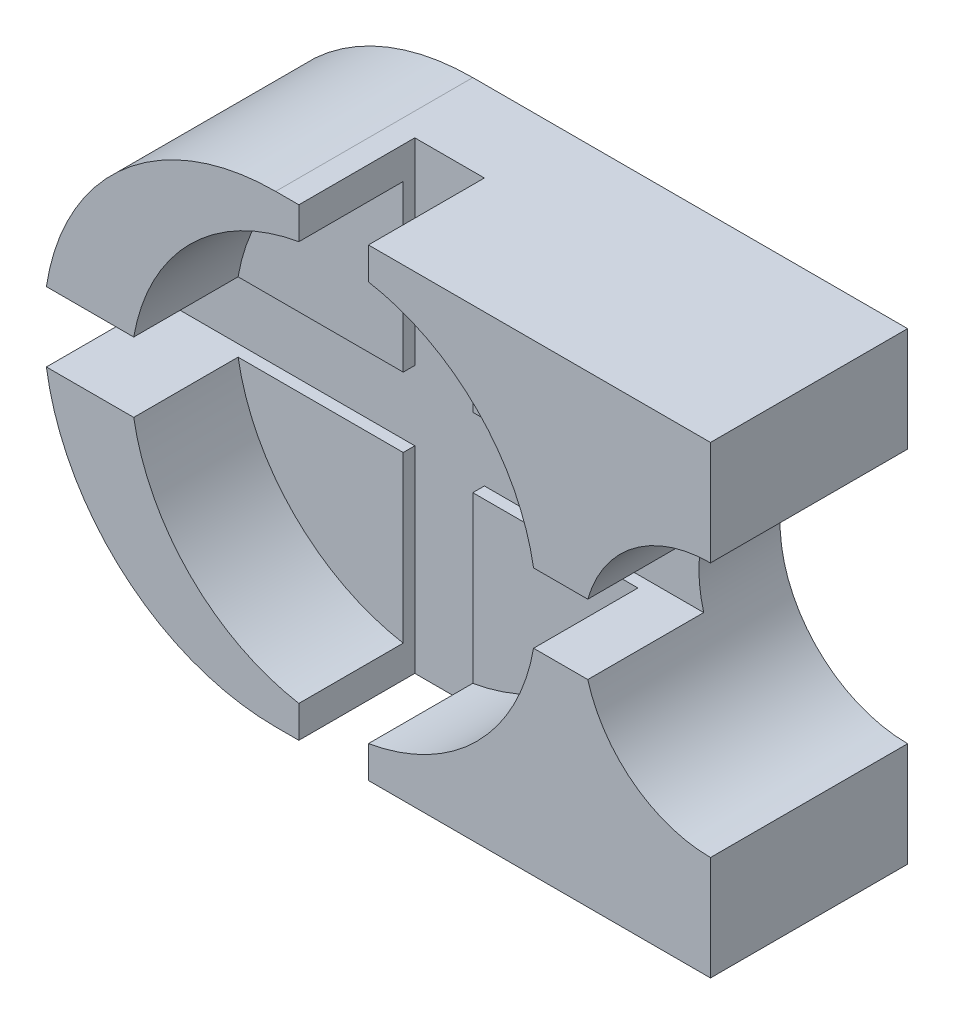
ISO-10303-21;
HEADER;
FILE_DESCRIPTION(('STEP AP214'),'2;1');
FILE_NAME('part.step','',(''),(''),'','','');
FILE_SCHEMA(('AUTOMOTIVE_DESIGN { 1 0 10303 214 1 1 1 1 }'));
ENDSEC;
DATA;
#1=APPLICATION_CONTEXT('core data for automotive mechanical design processes');
#2=APPLICATION_PROTOCOL_DEFINITION('international standard','automotive_design',2000,#1);
#3=PRODUCT_CONTEXT('',#1,'mechanical');
#4=PRODUCT('Part','Part','',(#3));
#5=PRODUCT_RELATED_PRODUCT_CATEGORY('part','',(#4));
#6=PRODUCT_DEFINITION_FORMATION('','',#4);
#7=PRODUCT_DEFINITION_CONTEXT('part definition',#1,'design');
#8=PRODUCT_DEFINITION('design','',#6,#7);
#9=PRODUCT_DEFINITION_SHAPE('','',#8);
#10=(LENGTH_UNIT() NAMED_UNIT(*) SI_UNIT(.MILLI.,.METRE.));
#11=(NAMED_UNIT(*) PLANE_ANGLE_UNIT() SI_UNIT($,.RADIAN.));
#12=(NAMED_UNIT(*) SI_UNIT($,.STERADIAN.) SOLID_ANGLE_UNIT());
#13=UNCERTAINTY_MEASURE_WITH_UNIT(LENGTH_MEASURE(1.E-05),#10,'distance_accuracy_value','');
#14=(GEOMETRIC_REPRESENTATION_CONTEXT(3) GLOBAL_UNCERTAINTY_ASSIGNED_CONTEXT((#13)) GLOBAL_UNIT_ASSIGNED_CONTEXT((#10,
#11,#12)) REPRESENTATION_CONTEXT('',''));
#15=CARTESIAN_POINT('',(0.,0.,0.));
#16=DIRECTION('',(0.,0.,1.));
#17=DIRECTION('',(1.,0.,0.));
#18=AXIS2_PLACEMENT_3D('',#15,#16,#17);
#19=CARTESIAN_POINT('',(75.,0.,34.));
#20=DIRECTION('',(0.,0.,-1.));
#21=DIRECTION('',(-1.,0.,0.));
#22=AXIS2_PLACEMENT_3D('',#19,#20,#21);
#23=CYLINDRICAL_SURFACE('',#22,22.);
#24=CARTESIAN_POINT('',(75.,0.,34.));
#25=DIRECTION('',(0.,0.,1.));
#26=DIRECTION('',(1.,0.,0.));
#27=AXIS2_PLACEMENT_3D('',#24,#25,#26);
#28=CIRCLE('',#27,22.);
#29=CARTESIAN_POINT('',(75.,22.,34.));
#30=VERTEX_POINT('',#29);
#31=CARTESIAN_POINT('',(53.8339895114833,5.99999999999999,34.));
#32=VERTEX_POINT('',#31);
#33=EDGE_CURVE('E265',#30,#32,#28,.T.);
#34=ORIENTED_EDGE('',*,*,#33,.T.);
#35=DIRECTION('',(0.,0.,1.));
#36=VECTOR('',#35,1.);
#37=CARTESIAN_POINT('',(53.8339895114833,5.99999999999999,14.));
#38=LINE('',#37,#36);
#39=CARTESIAN_POINT('',(53.8339895114833,5.99999999999999,14.));
#40=VERTEX_POINT('',#39);
#41=EDGE_CURVE('E304',#40,#32,#38,.T.);
#42=ORIENTED_EDGE('',*,*,#41,.F.);
#43=CARTESIAN_POINT('',(75.,0.,14.));
#44=DIRECTION('',(0.,0.,1.));
#45=DIRECTION('',(1.,0.,0.));
#46=AXIS2_PLACEMENT_3D('',#43,#44,#45);
#47=CIRCLE('',#46,22.);
#48=CARTESIAN_POINT('',(53.8339895114833,-6.00000000000001,14.));
#49=VERTEX_POINT('',#48);
#50=EDGE_CURVE('E505',#40,#49,#47,.T.);
#51=ORIENTED_EDGE('',*,*,#50,.T.);
#52=DIRECTION('',(0.,0.,1.));
#53=VECTOR('',#52,1.);
#54=CARTESIAN_POINT('',(53.8339895114833,-6.00000000000001,14.));
#55=LINE('',#54,#53);
#56=CARTESIAN_POINT('',(53.8339895114833,-6.00000000000001,34.));
#57=VERTEX_POINT('',#56);
#58=EDGE_CURVE('E428',#49,#57,#55,.T.);
#59=ORIENTED_EDGE('',*,*,#58,.T.);
#60=CARTESIAN_POINT('',(75.,-22.,34.));
#61=VERTEX_POINT('',#60);
#62=EDGE_CURVE('E64',#57,#61,#28,.T.);
#63=ORIENTED_EDGE('',*,*,#62,.T.);
#64=DIRECTION('',(0.,0.,-1.));
#65=VECTOR('',#64,1.);
#66=CARTESIAN_POINT('',(75.,-22.,34.));
#67=LINE('',#66,#65);
#68=CARTESIAN_POINT('',(75.,-22.,0.));
#69=VERTEX_POINT('',#68);
#70=EDGE_CURVE('E89',#61,#69,#67,.T.);
#71=ORIENTED_EDGE('',*,*,#70,.T.);
#72=CARTESIAN_POINT('',(75.,0.,0.));
#73=DIRECTION('',(0.,0.,1.));
#74=DIRECTION('',(1.,0.,0.));
#75=AXIS2_PLACEMENT_3D('',#72,#73,#74);
#76=CIRCLE('',#75,22.);
#77=CARTESIAN_POINT('',(75.,22.,0.));
#78=VERTEX_POINT('',#77);
#79=EDGE_CURVE('E156',#78,#69,#76,.T.);
#80=ORIENTED_EDGE('',*,*,#79,.F.);
#81=DIRECTION('',(0.,0.,-1.));
#82=VECTOR('',#81,1.);
#83=CARTESIAN_POINT('',(75.,22.,34.));
#84=LINE('',#83,#82);
#85=EDGE_CURVE('E95',#30,#78,#84,.T.);
#86=ORIENTED_EDGE('',*,*,#85,.F.);
#87=EDGE_LOOP('',(#34,#42,#51,#59,#63,#71,#80,#86));
#88=FACE_BOUND('',#87,.T.);
#89=ADVANCED_FACE('F40',(#88),#23,.F.);
#90=CARTESIAN_POINT('',(0.,0.,34.));
#91=DIRECTION('',(0.,0.,-1.));
#92=DIRECTION('',(-1.,0.,0.));
#93=AXIS2_PLACEMENT_3D('',#90,#91,#92);
#94=CYLINDRICAL_SURFACE('',#93,40.);
#95=DIRECTION('',(0.,0.,1.));
#96=VECTOR('',#95,1.);
#97=CARTESIAN_POINT('',(-39.5474398665704,5.99999999999999,14.));
#98=LINE('',#97,#96);
#99=CARTESIAN_POINT('',(-39.5474398665704,5.99999999999999,14.));
#100=VERTEX_POINT('',#99);
#101=CARTESIAN_POINT('',(-39.5474398665704,5.99999999999999,34.));
#102=VERTEX_POINT('',#101);
#103=EDGE_CURVE('E449',#100,#102,#98,.T.);
#104=ORIENTED_EDGE('',*,*,#103,.T.);
#105=CARTESIAN_POINT('',(0.,0.,34.));
#106=DIRECTION('',(0.,0.,1.));
#107=DIRECTION('',(1.,0.,0.));
#108=AXIS2_PLACEMENT_3D('',#105,#106,#107);
#109=CIRCLE('',#108,40.);
#110=CARTESIAN_POINT('',(0.,40.,34.));
#111=VERTEX_POINT('',#110);
#112=EDGE_CURVE('E122',#111,#102,#109,.T.);
#113=ORIENTED_EDGE('',*,*,#112,.F.);
#114=DIRECTION('',(0.,0.,-1.));
#115=VECTOR('',#114,1.);
#116=CARTESIAN_POINT('',(0.,40.,34.));
#117=LINE('',#116,#115);
#118=CARTESIAN_POINT('',(0.,40.,0.));
#119=VERTEX_POINT('',#118);
#120=EDGE_CURVE('E135',#111,#119,#117,.T.);
#121=ORIENTED_EDGE('',*,*,#120,.T.);
#122=CARTESIAN_POINT('',(0.,0.,0.));
#123=DIRECTION('',(0.,0.,1.));
#124=DIRECTION('',(1.,0.,0.));
#125=AXIS2_PLACEMENT_3D('',#122,#123,#124);
#126=CIRCLE('',#125,40.);
#127=CARTESIAN_POINT('',(0.,-40.,0.));
#128=VERTEX_POINT('',#127);
#129=EDGE_CURVE('E130',#119,#128,#126,.T.);
#130=ORIENTED_EDGE('',*,*,#129,.T.);
#131=DIRECTION('',(0.,0.,-1.));
#132=VECTOR('',#131,1.);
#133=CARTESIAN_POINT('',(0.,-40.,34.));
#134=LINE('',#133,#132);
#135=CARTESIAN_POINT('',(0.,-40.,34.));
#136=VERTEX_POINT('',#135);
#137=EDGE_CURVE('E126',#136,#128,#134,.T.);
#138=ORIENTED_EDGE('',*,*,#137,.F.);
#139=CARTESIAN_POINT('',(-39.5474398665704,-6.00000000000001,34.));
#140=VERTEX_POINT('',#139);
#141=EDGE_CURVE('E109',#140,#136,#109,.T.);
#142=ORIENTED_EDGE('',*,*,#141,.F.);
#143=DIRECTION('',(0.,0.,1.));
#144=VECTOR('',#143,1.);
#145=CARTESIAN_POINT('',(-39.5474398665704,-6.00000000000001,14.));
#146=LINE('',#145,#144);
#147=CARTESIAN_POINT('',(-39.5474398665704,-6.00000000000001,14.));
#148=VERTEX_POINT('',#147);
#149=EDGE_CURVE('E445',#148,#140,#146,.T.);
#150=ORIENTED_EDGE('',*,*,#149,.F.);
#151=CARTESIAN_POINT('',(0.,0.,14.));
#152=DIRECTION('',(0.,0.,1.));
#153=DIRECTION('',(1.,0.,0.));
#154=AXIS2_PLACEMENT_3D('',#151,#152,#153);
#155=CIRCLE('',#154,40.);
#156=EDGE_CURVE('E534',#100,#148,#155,.T.);
#157=ORIENTED_EDGE('',*,*,#156,.F.);
#158=EDGE_LOOP('',(#104,#113,#121,#130,#138,#142,#150,#157));
#159=FACE_BOUND('',#158,.T.);
#160=ADVANCED_FACE('F128',(#159),#94,.T.);
#161=CARTESIAN_POINT('',(0.,-40.,34.));
#162=DIRECTION('',(0.,1.,0.));
#163=DIRECTION('',(0.,0.,1.));
#164=AXIS2_PLACEMENT_3D('',#161,#162,#163);
#165=PLANE('',#164);
#166=DIRECTION('',(0.,0.,1.));
#167=VECTOR('',#166,1.);
#168=CARTESIAN_POINT('',(16.,-40.,14.));
#169=LINE('',#168,#167);
#170=CARTESIAN_POINT('',(16.,-40.,14.));
#171=VERTEX_POINT('',#170);
#172=CARTESIAN_POINT('',(16.,-40.,34.));
#173=VERTEX_POINT('',#172);
#174=EDGE_CURVE('E435',#171,#173,#169,.T.);
#175=ORIENTED_EDGE('',*,*,#174,.F.);
#176=DIRECTION('',(1.,0.,0.));
#177=VECTOR('',#176,1.);
#178=CARTESIAN_POINT('',(0.,-40.,14.));
#179=LINE('',#178,#177);
#180=CARTESIAN_POINT('',(4.,-40.,14.));
#181=VERTEX_POINT('',#180);
#182=EDGE_CURVE('E519',#181,#171,#179,.T.);
#183=ORIENTED_EDGE('',*,*,#182,.F.);
#184=DIRECTION('',(0.,0.,1.));
#185=VECTOR('',#184,1.);
#186=CARTESIAN_POINT('',(4.,-40.,14.));
#187=LINE('',#186,#185);
#188=CARTESIAN_POINT('',(4.,-40.,34.));
#189=VERTEX_POINT('',#188);
#190=EDGE_CURVE('E143',#181,#189,#187,.T.);
#191=ORIENTED_EDGE('',*,*,#190,.T.);
#192=DIRECTION('',(1.,0.,0.));
#193=VECTOR('',#192,1.);
#194=CARTESIAN_POINT('',(0.,-40.,34.));
#195=LINE('',#194,#193);
#196=EDGE_CURVE('E115',#136,#189,#195,.T.);
#197=ORIENTED_EDGE('',*,*,#196,.F.);
#198=ORIENTED_EDGE('',*,*,#137,.T.);
#199=DIRECTION('',(1.,0.,0.));
#200=VECTOR('',#199,1.);
#201=CARTESIAN_POINT('',(0.,-40.,0.));
#202=LINE('',#201,#200);
#203=CARTESIAN_POINT('',(75.,-40.,0.));
#204=VERTEX_POINT('',#203);
#205=EDGE_CURVE('E171',#128,#204,#202,.T.);
#206=ORIENTED_EDGE('',*,*,#205,.T.);
#207=DIRECTION('',(0.,0.,-1.));
#208=VECTOR('',#207,1.);
#209=CARTESIAN_POINT('',(75.,-40.,34.));
#210=LINE('',#209,#208);
#211=CARTESIAN_POINT('',(75.,-40.,34.));
#212=VERTEX_POINT('',#211);
#213=EDGE_CURVE('E136',#212,#204,#210,.T.);
#214=ORIENTED_EDGE('',*,*,#213,.F.);
#215=EDGE_CURVE('E146',#173,#212,#195,.T.);
#216=ORIENTED_EDGE('',*,*,#215,.F.);
#217=EDGE_LOOP('',(#175,#183,#191,#197,#198,#206,#214,#216));
#218=FACE_BOUND('',#217,.T.);
#219=ADVANCED_FACE('F140',(#218),#165,.F.);
#220=CARTESIAN_POINT('',(0.,0.,34.));
#221=DIRECTION('',(0.,0.,1.));
#222=DIRECTION('',(1.,0.,0.));
#223=AXIS2_PLACEMENT_3D('',#220,#221,#222);
#224=PLANE('',#223);
#225=ORIENTED_EDGE('',*,*,#112,.T.);
#226=DIRECTION('',(1.,0.,0.));
#227=VECTOR('',#226,1.);
#228=CARTESIAN_POINT('',(0.,5.99999999999999,34.));
#229=LINE('',#228,#227);
#230=CARTESIAN_POINT('',(-24.4818792991333,5.99999999999999,34.));
#231=VERTEX_POINT('',#230);
#232=EDGE_CURVE('E360',#102,#231,#229,.T.);
#233=ORIENTED_EDGE('',*,*,#232,.T.);
#234=CARTESIAN_POINT('',(10.,0.,34.));
#235=DIRECTION('',(0.,0.,1.));
#236=DIRECTION('',(1.,0.,0.));
#237=AXIS2_PLACEMENT_3D('',#234,#235,#236);
#238=CIRCLE('',#237,35.);
#239=CARTESIAN_POINT('',(4.,34.4818792991333,34.));
#240=VERTEX_POINT('',#239);
#241=EDGE_CURVE('E263',#240,#231,#238,.T.);
#242=ORIENTED_EDGE('',*,*,#241,.F.);
#243=DIRECTION('',(0.,-1.,0.));
#244=VECTOR('',#243,1.);
#245=CARTESIAN_POINT('',(4.,0.,34.));
#246=LINE('',#245,#244);
#247=CARTESIAN_POINT('',(4.,40.,34.));
#248=VERTEX_POINT('',#247);
#249=EDGE_CURVE('E415',#248,#240,#246,.T.);
#250=ORIENTED_EDGE('',*,*,#249,.F.);
#251=DIRECTION('',(1.,0.,0.));
#252=VECTOR('',#251,1.);
#253=CARTESIAN_POINT('',(0.,40.,34.));
#254=LINE('',#253,#252);
#255=EDGE_CURVE('E123',#111,#248,#254,.T.);
#256=ORIENTED_EDGE('',*,*,#255,.F.);
#257=EDGE_LOOP('',(#225,#233,#242,#250,#256));
#258=FACE_BOUND('',#257,.T.);
#259=ADVANCED_FACE('F366',(#258),#224,.T.);
#260=CARTESIAN_POINT('',(16.,40.,34.));
#261=VERTEX_POINT('',#260);
#262=CARTESIAN_POINT('',(75.,40.,34.));
#263=VERTEX_POINT('',#262);
#264=EDGE_CURVE('E269',#261,#263,#254,.T.);
#265=ORIENTED_EDGE('',*,*,#264,.F.);
#266=DIRECTION('',(0.,-1.,0.));
#267=VECTOR('',#266,1.);
#268=CARTESIAN_POINT('',(16.,0.,34.));
#269=LINE('',#268,#267);
#270=CARTESIAN_POINT('',(16.,34.4818792991333,34.));
#271=VERTEX_POINT('',#270);
#272=EDGE_CURVE('E407',#261,#271,#269,.T.);
#273=ORIENTED_EDGE('',*,*,#272,.T.);
#274=CARTESIAN_POINT('',(44.4818792991333,5.99999999999999,34.));
#275=VERTEX_POINT('',#274);
#276=EDGE_CURVE('E259',#275,#271,#238,.T.);
#277=ORIENTED_EDGE('',*,*,#276,.F.);
#278=DIRECTION('',(1.,0.,0.));
#279=VECTOR('',#278,1.);
#280=CARTESIAN_POINT('',(0.,5.99999999999999,34.));
#281=LINE('',#280,#279);
#282=EDGE_CURVE('E299',#275,#32,#281,.T.);
#283=ORIENTED_EDGE('',*,*,#282,.T.);
#284=ORIENTED_EDGE('',*,*,#33,.F.);
#285=DIRECTION('',(0.,-1.,0.));
#286=VECTOR('',#285,1.);
#287=CARTESIAN_POINT('',(75.,0.,34.));
#288=LINE('',#287,#286);
#289=EDGE_CURVE('E153',#263,#30,#288,.T.);
#290=ORIENTED_EDGE('',*,*,#289,.F.);
#291=EDGE_LOOP('',(#265,#273,#277,#283,#284,#290));
#292=FACE_BOUND('',#291,.T.);
#293=ADVANCED_FACE('F294',(#292),#224,.T.);
#294=DIRECTION('',(1.,0.,0.));
#295=VECTOR('',#294,1.);
#296=CARTESIAN_POINT('',(0.,-6.00000000000001,34.));
#297=LINE('',#296,#295);
#298=CARTESIAN_POINT('',(44.4818792991333,-6.00000000000001,34.));
#299=VERTEX_POINT('',#298);
#300=EDGE_CURVE('E398',#299,#57,#297,.T.);
#301=ORIENTED_EDGE('',*,*,#300,.F.);
#302=CARTESIAN_POINT('',(16.,-34.4818792991333,34.));
#303=VERTEX_POINT('',#302);
#304=EDGE_CURVE('E264',#303,#299,#238,.T.);
#305=ORIENTED_EDGE('',*,*,#304,.F.);
#306=DIRECTION('',(0.,-1.,0.));
#307=VECTOR('',#306,1.);
#308=CARTESIAN_POINT('',(16.,0.,34.));
#309=LINE('',#308,#307);
#310=EDGE_CURVE('E396',#303,#173,#309,.T.);
#311=ORIENTED_EDGE('',*,*,#310,.T.);
#312=ORIENTED_EDGE('',*,*,#215,.T.);
#313=EDGE_CURVE('E145',#61,#212,#288,.T.);
#314=ORIENTED_EDGE('',*,*,#313,.F.);
#315=ORIENTED_EDGE('',*,*,#62,.F.);
#316=EDGE_LOOP('',(#301,#305,#311,#312,#314,#315));
#317=FACE_BOUND('',#316,.T.);
#318=ADVANCED_FACE('F395',(#317),#224,.T.);
#319=CARTESIAN_POINT('',(10.,0.,16.));
#320=DIRECTION('',(0.,0.,1.));
#321=DIRECTION('',(1.,0.,0.));
#322=AXIS2_PLACEMENT_3D('',#319,#320,#321);
#323=CYLINDRICAL_SURFACE('',#322,35.);
#324=DIRECTION('',(0.,0.,1.));
#325=VECTOR('',#324,1.);
#326=CARTESIAN_POINT('',(-24.4818792991333,5.99999999999999,16.));
#327=LINE('',#326,#325);
#328=CARTESIAN_POINT('',(-24.4818792991333,5.99999999999999,16.));
#329=VERTEX_POINT('',#328);
#330=EDGE_CURVE('E257',#329,#231,#327,.T.);
#331=ORIENTED_EDGE('',*,*,#330,.F.);
#332=CARTESIAN_POINT('',(10.,0.,16.));
#333=DIRECTION('',(0.,0.,1.));
#334=DIRECTION('',(1.,0.,0.));
#335=AXIS2_PLACEMENT_3D('',#332,#333,#334);
#336=CIRCLE('',#335,35.);
#337=CARTESIAN_POINT('',(4.,34.4818792991333,16.));
#338=VERTEX_POINT('',#337);
#339=EDGE_CURVE('E243',#338,#329,#336,.T.);
#340=ORIENTED_EDGE('',*,*,#339,.F.);
#341=DIRECTION('',(0.,0.,1.));
#342=VECTOR('',#341,1.);
#343=CARTESIAN_POINT('',(4.,34.4818792991333,16.));
#344=LINE('',#343,#342);
#345=EDGE_CURVE('E224',#338,#240,#344,.T.);
#346=ORIENTED_EDGE('',*,*,#345,.T.);
#347=ORIENTED_EDGE('',*,*,#241,.T.);
#348=EDGE_LOOP('',(#331,#340,#346,#347));
#349=FACE_BOUND('',#348,.T.);
#350=ADVANCED_FACE('F371',(#349),#323,.F.);
#351=DIRECTION('',(0.,0.,1.));
#352=VECTOR('',#351,1.);
#353=CARTESIAN_POINT('',(16.,34.4818792991333,16.));
#354=LINE('',#353,#352);
#355=CARTESIAN_POINT('',(16.,34.4818792991333,16.));
#356=VERTEX_POINT('',#355);
#357=EDGE_CURVE('E465',#356,#271,#354,.T.);
#358=ORIENTED_EDGE('',*,*,#357,.F.);
#359=CARTESIAN_POINT('',(44.4818792991333,5.99999999999999,16.));
#360=VERTEX_POINT('',#359);
#361=EDGE_CURVE('E160',#360,#356,#336,.T.);
#362=ORIENTED_EDGE('',*,*,#361,.F.);
#363=DIRECTION('',(0.,0.,1.));
#364=VECTOR('',#363,1.);
#365=CARTESIAN_POINT('',(44.4818792991333,5.99999999999999,16.));
#366=LINE('',#365,#364);
#367=EDGE_CURVE('E462',#275,#360,#366,.F.);
#368=ORIENTED_EDGE('',*,*,#367,.F.);
#369=ORIENTED_EDGE('',*,*,#276,.T.);
#370=EDGE_LOOP('',(#358,#362,#368,#369));
#371=FACE_BOUND('',#370,.T.);
#372=ADVANCED_FACE('F604',(#371),#323,.F.);
#373=ORIENTED_EDGE('',*,*,#304,.T.);
#374=DIRECTION('',(0.,0.,1.));
#375=VECTOR('',#374,1.);
#376=CARTESIAN_POINT('',(44.4818792991333,-6.00000000000001,16.));
#377=LINE('',#376,#375);
#378=CARTESIAN_POINT('',(44.4818792991333,-6.00000000000001,16.));
#379=VERTEX_POINT('',#378);
#380=EDGE_CURVE('E389',#299,#379,#377,.F.);
#381=ORIENTED_EDGE('',*,*,#380,.T.);
#382=CARTESIAN_POINT('',(16.,-34.4818792991333,16.));
#383=VERTEX_POINT('',#382);
#384=EDGE_CURVE('E253',#383,#379,#336,.T.);
#385=ORIENTED_EDGE('',*,*,#384,.F.);
#386=DIRECTION('',(0.,0.,1.));
#387=VECTOR('',#386,1.);
#388=CARTESIAN_POINT('',(16.,-34.4818792991333,16.));
#389=LINE('',#388,#387);
#390=EDGE_CURVE('E391',#303,#383,#389,.F.);
#391=ORIENTED_EDGE('',*,*,#390,.F.);
#392=EDGE_LOOP('',(#373,#381,#385,#391));
#393=FACE_BOUND('',#392,.T.);
#394=ADVANCED_FACE('F387',(#393),#323,.F.);
#395=CARTESIAN_POINT('',(10.,0.,16.));
#396=DIRECTION('',(0.,0.,1.));
#397=DIRECTION('',(1.,0.,0.));
#398=AXIS2_PLACEMENT_3D('',#395,#396,#397);
#399=PLANE('',#398);
#400=ORIENTED_EDGE('',*,*,#339,.T.);
#401=DIRECTION('',(1.,0.,0.));
#402=VECTOR('',#401,1.);
#403=CARTESIAN_POINT('',(10.,5.99999999999999,16.));
#404=LINE('',#403,#402);
#405=CARTESIAN_POINT('',(4.,5.99999999999999,16.));
#406=VERTEX_POINT('',#405);
#407=EDGE_CURVE('E11',#329,#406,#404,.T.);
#408=ORIENTED_EDGE('',*,*,#407,.T.);
#409=DIRECTION('',(0.,-1.,0.));
#410=VECTOR('',#409,1.);
#411=CARTESIAN_POINT('',(4.,0.,16.));
#412=LINE('',#411,#410);
#413=EDGE_CURVE('E48',#338,#406,#412,.T.);
#414=ORIENTED_EDGE('',*,*,#413,.F.);
#415=EDGE_LOOP('',(#400,#408,#414));
#416=FACE_BOUND('',#415,.T.);
#417=ADVANCED_FACE('F242',(#416),#399,.T.);
#418=ORIENTED_EDGE('',*,*,#361,.T.);
#419=DIRECTION('',(0.,-1.,0.));
#420=VECTOR('',#419,1.);
#421=CARTESIAN_POINT('',(16.,0.,16.));
#422=LINE('',#421,#420);
#423=CARTESIAN_POINT('',(16.,5.99999999999999,16.));
#424=VERTEX_POINT('',#423);
#425=EDGE_CURVE('E204',#356,#424,#422,.T.);
#426=ORIENTED_EDGE('',*,*,#425,.T.);
#427=DIRECTION('',(1.,0.,0.));
#428=VECTOR('',#427,1.);
#429=CARTESIAN_POINT('',(10.,5.99999999999999,16.));
#430=LINE('',#429,#428);
#431=EDGE_CURVE('E200',#424,#360,#430,.T.);
#432=ORIENTED_EDGE('',*,*,#431,.T.);
#433=EDGE_LOOP('',(#418,#426,#432));
#434=FACE_BOUND('',#433,.T.);
#435=ADVANCED_FACE('F600',(#434),#399,.T.);
#436=DIRECTION('',(1.,0.,0.));
#437=VECTOR('',#436,1.);
#438=CARTESIAN_POINT('',(10.,-6.00000000000001,16.));
#439=LINE('',#438,#437);
#440=CARTESIAN_POINT('',(16.,-6.00000000000001,16.));
#441=VERTEX_POINT('',#440);
#442=EDGE_CURVE('E196',#441,#379,#439,.T.);
#443=ORIENTED_EDGE('',*,*,#442,.F.);
#444=DIRECTION('',(0.,-1.,0.));
#445=VECTOR('',#444,1.);
#446=CARTESIAN_POINT('',(16.,0.,16.));
#447=LINE('',#446,#445);
#448=EDGE_CURVE('E192',#441,#383,#447,.T.);
#449=ORIENTED_EDGE('',*,*,#448,.T.);
#450=ORIENTED_EDGE('',*,*,#384,.T.);
#451=EDGE_LOOP('',(#443,#449,#450));
#452=FACE_BOUND('',#451,.T.);
#453=ADVANCED_FACE('F631',(#452),#399,.T.);
#454=CARTESIAN_POINT('',(75.,0.,34.));
#455=DIRECTION('',(1.,0.,0.));
#456=DIRECTION('',(0.,0.,-1.));
#457=AXIS2_PLACEMENT_3D('',#454,#455,#456);
#458=PLANE('',#457);
#459=DIRECTION('',(0.,-1.,0.));
#460=VECTOR('',#459,1.);
#461=CARTESIAN_POINT('',(75.,0.,0.));
#462=LINE('',#461,#460);
#463=CARTESIAN_POINT('',(75.,40.,0.));
#464=VERTEX_POINT('',#463);
#465=EDGE_CURVE('E159',#464,#78,#462,.T.);
#466=ORIENTED_EDGE('',*,*,#465,.F.);
#467=DIRECTION('',(0.,0.,-1.));
#468=VECTOR('',#467,1.);
#469=CARTESIAN_POINT('',(75.,40.,34.));
#470=LINE('',#469,#468);
#471=EDGE_CURVE('E180',#263,#464,#470,.T.);
#472=ORIENTED_EDGE('',*,*,#471,.F.);
#473=ORIENTED_EDGE('',*,*,#289,.T.);
#474=ORIENTED_EDGE('',*,*,#85,.T.);
#475=EDGE_LOOP('',(#466,#472,#473,#474));
#476=FACE_BOUND('',#475,.T.);
#477=ADVANCED_FACE('F293',(#476),#458,.T.);
#478=CARTESIAN_POINT('',(0.,40.,34.));
#479=DIRECTION('',(0.,1.,0.));
#480=DIRECTION('',(0.,0.,1.));
#481=AXIS2_PLACEMENT_3D('',#478,#479,#480);
#482=PLANE('',#481);
#483=DIRECTION('',(0.,0.,1.));
#484=VECTOR('',#483,1.);
#485=CARTESIAN_POINT('',(4.,40.,14.));
#486=LINE('',#485,#484);
#487=CARTESIAN_POINT('',(4.,40.,14.));
#488=VERTEX_POINT('',#487);
#489=EDGE_CURVE('E240',#488,#248,#486,.T.);
#490=ORIENTED_EDGE('',*,*,#489,.F.);
#491=DIRECTION('',(-1.,0.,0.));
#492=VECTOR('',#491,1.);
#493=CARTESIAN_POINT('',(0.,40.,14.));
#494=LINE('',#493,#492);
#495=CARTESIAN_POINT('',(16.,40.,14.));
#496=VERTEX_POINT('',#495);
#497=EDGE_CURVE('E491',#496,#488,#494,.T.);
#498=ORIENTED_EDGE('',*,*,#497,.F.);
#499=DIRECTION('',(0.,0.,1.));
#500=VECTOR('',#499,1.);
#501=CARTESIAN_POINT('',(16.,40.,14.));
#502=LINE('',#501,#500);
#503=EDGE_CURVE('E288',#496,#261,#502,.T.);
#504=ORIENTED_EDGE('',*,*,#503,.T.);
#505=ORIENTED_EDGE('',*,*,#264,.T.);
#506=ORIENTED_EDGE('',*,*,#471,.T.);
#507=DIRECTION('',(1.,0.,0.));
#508=VECTOR('',#507,1.);
#509=CARTESIAN_POINT('',(0.,40.,0.));
#510=LINE('',#509,#508);
#511=EDGE_CURVE('E164',#119,#464,#510,.T.);
#512=ORIENTED_EDGE('',*,*,#511,.F.);
#513=ORIENTED_EDGE('',*,*,#120,.F.);
#514=ORIENTED_EDGE('',*,*,#255,.T.);
#515=EDGE_LOOP('',(#490,#498,#504,#505,#506,#512,#513,#514));
#516=FACE_BOUND('',#515,.T.);
#517=ADVANCED_FACE('F282',(#516),#482,.T.);
#518=EDGE_CURVE('E165',#69,#204,#462,.T.);
#519=ORIENTED_EDGE('',*,*,#518,.F.);
#520=ORIENTED_EDGE('',*,*,#70,.F.);
#521=ORIENTED_EDGE('',*,*,#313,.T.);
#522=ORIENTED_EDGE('',*,*,#213,.T.);
#523=EDGE_LOOP('',(#519,#520,#521,#522));
#524=FACE_BOUND('',#523,.T.);
#525=ADVANCED_FACE('F625',(#524),#458,.T.);
#526=DIRECTION('',(0.,-1.,0.));
#527=VECTOR('',#526,1.);
#528=CARTESIAN_POINT('',(4.,0.,34.));
#529=LINE('',#528,#527);
#530=CARTESIAN_POINT('',(4.,-34.4818792991333,34.));
#531=VERTEX_POINT('',#530);
#532=EDGE_CURVE('E409',#531,#189,#529,.T.);
#533=ORIENTED_EDGE('',*,*,#532,.F.);
#534=CARTESIAN_POINT('',(-24.4818792991333,-6.00000000000001,34.));
#535=VERTEX_POINT('',#534);
#536=EDGE_CURVE('E373',#535,#531,#238,.T.);
#537=ORIENTED_EDGE('',*,*,#536,.F.);
#538=DIRECTION('',(1.,0.,0.));
#539=VECTOR('',#538,1.);
#540=CARTESIAN_POINT('',(0.,-6.00000000000001,34.));
#541=LINE('',#540,#539);
#542=EDGE_CURVE('E118',#140,#535,#541,.T.);
#543=ORIENTED_EDGE('',*,*,#542,.F.);
#544=ORIENTED_EDGE('',*,*,#141,.T.);
#545=ORIENTED_EDGE('',*,*,#196,.T.);
#546=EDGE_LOOP('',(#533,#537,#543,#544,#545));
#547=FACE_BOUND('',#546,.T.);
#548=ADVANCED_FACE('F112',(#547),#224,.T.);
#549=CARTESIAN_POINT('',(0.,0.,0.));
#550=DIRECTION('',(0.,0.,1.));
#551=DIRECTION('',(1.,0.,0.));
#552=AXIS2_PLACEMENT_3D('',#549,#550,#551);
#553=PLANE('',#552);
#554=ORIENTED_EDGE('',*,*,#79,.T.);
#555=ORIENTED_EDGE('',*,*,#518,.T.);
#556=ORIENTED_EDGE('',*,*,#205,.F.);
#557=ORIENTED_EDGE('',*,*,#129,.F.);
#558=ORIENTED_EDGE('',*,*,#511,.T.);
#559=ORIENTED_EDGE('',*,*,#465,.T.);
#560=EDGE_LOOP('',(#554,#555,#556,#557,#558,#559));
#561=FACE_BOUND('',#560,.T.);
#562=ADVANCED_FACE('F638',(#561),#553,.F.);
#563=ORIENTED_EDGE('',*,*,#536,.T.);
#564=DIRECTION('',(0.,0.,1.));
#565=VECTOR('',#564,1.);
#566=CARTESIAN_POINT('',(4.,-34.4818792991333,16.));
#567=LINE('',#566,#565);
#568=CARTESIAN_POINT('',(4.,-34.4818792991333,16.));
#569=VERTEX_POINT('',#568);
#570=EDGE_CURVE('E455',#531,#569,#567,.F.);
#571=ORIENTED_EDGE('',*,*,#570,.T.);
#572=CARTESIAN_POINT('',(-24.4818792991333,-6.00000000000001,16.));
#573=VERTEX_POINT('',#572);
#574=EDGE_CURVE('E247',#573,#569,#336,.T.);
#575=ORIENTED_EDGE('',*,*,#574,.F.);
#576=DIRECTION('',(0.,0.,1.));
#577=VECTOR('',#576,1.);
#578=CARTESIAN_POINT('',(-24.4818792991333,-6.00000000000001,16.));
#579=LINE('',#578,#577);
#580=EDGE_CURVE('E55',#573,#535,#579,.T.);
#581=ORIENTED_EDGE('',*,*,#580,.T.);
#582=EDGE_LOOP('',(#563,#571,#575,#581));
#583=FACE_BOUND('',#582,.T.);
#584=ADVANCED_FACE('F611',(#583),#323,.F.);
#585=DIRECTION('',(0.,-1.,0.));
#586=VECTOR('',#585,1.);
#587=CARTESIAN_POINT('',(4.,0.,16.));
#588=LINE('',#587,#586);
#589=CARTESIAN_POINT('',(4.,-6.00000000000001,16.));
#590=VERTEX_POINT('',#589);
#591=EDGE_CURVE('E188',#590,#569,#588,.T.);
#592=ORIENTED_EDGE('',*,*,#591,.F.);
#593=DIRECTION('',(1.,0.,0.));
#594=VECTOR('',#593,1.);
#595=CARTESIAN_POINT('',(10.,-6.00000000000001,16.));
#596=LINE('',#595,#594);
#597=EDGE_CURVE('E185',#573,#590,#596,.T.);
#598=ORIENTED_EDGE('',*,*,#597,.F.);
#599=ORIENTED_EDGE('',*,*,#574,.T.);
#600=EDGE_LOOP('',(#592,#598,#599));
#601=FACE_BOUND('',#600,.T.);
#602=ADVANCED_FACE('F636',(#601),#399,.T.);
#603=CARTESIAN_POINT('',(0.,5.99999999999999,14.));
#604=DIRECTION('',(0.,-1.,0.));
#605=DIRECTION('',(1.,0.,0.));
#606=AXIS2_PLACEMENT_3D('',#603,#604,#605);
#607=PLANE('',#606);
#608=ORIENTED_EDGE('',*,*,#330,.T.);
#609=ORIENTED_EDGE('',*,*,#232,.F.);
#610=ORIENTED_EDGE('',*,*,#103,.F.);
#611=DIRECTION('',(1.,0.,0.));
#612=VECTOR('',#611,1.);
#613=CARTESIAN_POINT('',(0.,5.99999999999999,14.));
#614=LINE('',#613,#612);
#615=CARTESIAN_POINT('',(4.,5.99999999999999,14.));
#616=VERTEX_POINT('',#615);
#617=EDGE_CURVE('E238',#100,#616,#614,.T.);
#618=ORIENTED_EDGE('',*,*,#617,.T.);
#619=DIRECTION('',(0.,0.,1.));
#620=VECTOR('',#619,1.);
#621=CARTESIAN_POINT('',(4.,5.99999999999999,14.));
#622=LINE('',#621,#620);
#623=EDGE_CURVE('E219',#616,#406,#622,.T.);
#624=ORIENTED_EDGE('',*,*,#623,.T.);
#625=ORIENTED_EDGE('',*,*,#407,.F.);
#626=EDGE_LOOP('',(#608,#609,#610,#618,#624,#625));
#627=FACE_BOUND('',#626,.T.);
#628=ADVANCED_FACE('F234',(#627),#607,.T.);
#629=CARTESIAN_POINT('',(4.,0.,14.));
#630=DIRECTION('',(-1.,0.,0.));
#631=DIRECTION('',(0.,-1.,0.));
#632=AXIS2_PLACEMENT_3D('',#629,#630,#631);
#633=PLANE('',#632);
#634=ORIENTED_EDGE('',*,*,#413,.T.);
#635=ORIENTED_EDGE('',*,*,#623,.F.);
#636=DIRECTION('',(0.,-1.,0.));
#637=VECTOR('',#636,1.);
#638=CARTESIAN_POINT('',(4.,0.,14.));
#639=LINE('',#638,#637);
#640=EDGE_CURVE('E452',#488,#616,#639,.T.);
#641=ORIENTED_EDGE('',*,*,#640,.F.);
#642=ORIENTED_EDGE('',*,*,#489,.T.);
#643=ORIENTED_EDGE('',*,*,#249,.T.);
#644=ORIENTED_EDGE('',*,*,#345,.F.);
#645=EDGE_LOOP('',(#634,#635,#641,#642,#643,#644));
#646=FACE_BOUND('',#645,.T.);
#647=ADVANCED_FACE('F216',(#646),#633,.F.);
#648=CARTESIAN_POINT('',(16.,0.,14.));
#649=DIRECTION('',(-1.,0.,0.));
#650=DIRECTION('',(0.,-1.,0.));
#651=AXIS2_PLACEMENT_3D('',#648,#649,#650);
#652=PLANE('',#651);
#653=ORIENTED_EDGE('',*,*,#357,.T.);
#654=ORIENTED_EDGE('',*,*,#272,.F.);
#655=ORIENTED_EDGE('',*,*,#503,.F.);
#656=DIRECTION('',(0.,-1.,0.));
#657=VECTOR('',#656,1.);
#658=CARTESIAN_POINT('',(16.,0.,14.));
#659=LINE('',#658,#657);
#660=CARTESIAN_POINT('',(16.,5.99999999999999,14.));
#661=VERTEX_POINT('',#660);
#662=EDGE_CURVE('E496',#496,#661,#659,.T.);
#663=ORIENTED_EDGE('',*,*,#662,.T.);
#664=DIRECTION('',(0.,0.,1.));
#665=VECTOR('',#664,1.);
#666=CARTESIAN_POINT('',(16.,5.99999999999999,14.));
#667=LINE('',#666,#665);
#668=EDGE_CURVE('E422',#661,#424,#667,.T.);
#669=ORIENTED_EDGE('',*,*,#668,.T.);
#670=ORIENTED_EDGE('',*,*,#425,.F.);
#671=EDGE_LOOP('',(#653,#654,#655,#663,#669,#670));
#672=FACE_BOUND('',#671,.T.);
#673=ADVANCED_FACE('F597',(#672),#652,.T.);
#674=CARTESIAN_POINT('',(0.,5.99999999999999,14.));
#675=DIRECTION('',(0.,-1.,0.));
#676=DIRECTION('',(1.,0.,0.));
#677=AXIS2_PLACEMENT_3D('',#674,#675,#676);
#678=PLANE('',#677);
#679=ORIENTED_EDGE('',*,*,#367,.T.);
#680=ORIENTED_EDGE('',*,*,#431,.F.);
#681=ORIENTED_EDGE('',*,*,#668,.F.);
#682=DIRECTION('',(1.,0.,0.));
#683=VECTOR('',#682,1.);
#684=CARTESIAN_POINT('',(0.,5.99999999999999,14.));
#685=LINE('',#684,#683);
#686=EDGE_CURVE('E501',#661,#40,#685,.T.);
#687=ORIENTED_EDGE('',*,*,#686,.T.);
#688=ORIENTED_EDGE('',*,*,#41,.T.);
#689=ORIENTED_EDGE('',*,*,#282,.F.);
#690=EDGE_LOOP('',(#679,#680,#681,#687,#688,#689));
#691=FACE_BOUND('',#690,.T.);
#692=ADVANCED_FACE('F595',(#691),#678,.T.);
#693=CARTESIAN_POINT('',(0.,-6.00000000000001,14.));
#694=DIRECTION('',(0.,-1.,0.));
#695=DIRECTION('',(1.,0.,0.));
#696=AXIS2_PLACEMENT_3D('',#693,#694,#695);
#697=PLANE('',#696);
#698=ORIENTED_EDGE('',*,*,#300,.T.);
#699=ORIENTED_EDGE('',*,*,#58,.F.);
#700=DIRECTION('',(1.,0.,0.));
#701=VECTOR('',#700,1.);
#702=CARTESIAN_POINT('',(0.,-6.00000000000001,14.));
#703=LINE('',#702,#701);
#704=CARTESIAN_POINT('',(16.,-6.00000000000001,14.));
#705=VERTEX_POINT('',#704);
#706=EDGE_CURVE('E509',#705,#49,#703,.T.);
#707=ORIENTED_EDGE('',*,*,#706,.F.);
#708=DIRECTION('',(0.,0.,1.));
#709=VECTOR('',#708,1.);
#710=CARTESIAN_POINT('',(16.,-6.00000000000001,14.));
#711=LINE('',#710,#709);
#712=EDGE_CURVE('E431',#705,#441,#711,.T.);
#713=ORIENTED_EDGE('',*,*,#712,.T.);
#714=ORIENTED_EDGE('',*,*,#442,.T.);
#715=ORIENTED_EDGE('',*,*,#380,.F.);
#716=EDGE_LOOP('',(#698,#699,#707,#713,#714,#715));
#717=FACE_BOUND('',#716,.T.);
#718=ADVANCED_FACE('F590',(#717),#697,.F.);
#719=CARTESIAN_POINT('',(16.,0.,14.));
#720=DIRECTION('',(-1.,0.,0.));
#721=DIRECTION('',(0.,-1.,0.));
#722=AXIS2_PLACEMENT_3D('',#719,#720,#721);
#723=PLANE('',#722);
#724=ORIENTED_EDGE('',*,*,#390,.T.);
#725=ORIENTED_EDGE('',*,*,#448,.F.);
#726=ORIENTED_EDGE('',*,*,#712,.F.);
#727=DIRECTION('',(0.,-1.,0.));
#728=VECTOR('',#727,1.);
#729=CARTESIAN_POINT('',(16.,0.,14.));
#730=LINE('',#729,#728);
#731=EDGE_CURVE('E514',#705,#171,#730,.T.);
#732=ORIENTED_EDGE('',*,*,#731,.T.);
#733=ORIENTED_EDGE('',*,*,#174,.T.);
#734=ORIENTED_EDGE('',*,*,#310,.F.);
#735=EDGE_LOOP('',(#724,#725,#726,#732,#733,#734));
#736=FACE_BOUND('',#735,.T.);
#737=ADVANCED_FACE('F587',(#736),#723,.T.);
#738=CARTESIAN_POINT('',(4.,0.,14.));
#739=DIRECTION('',(-1.,0.,0.));
#740=DIRECTION('',(0.,-1.,0.));
#741=AXIS2_PLACEMENT_3D('',#738,#739,#740);
#742=PLANE('',#741);
#743=ORIENTED_EDGE('',*,*,#532,.T.);
#744=ORIENTED_EDGE('',*,*,#190,.F.);
#745=DIRECTION('',(0.,-1.,0.));
#746=VECTOR('',#745,1.);
#747=CARTESIAN_POINT('',(4.,0.,14.));
#748=LINE('',#747,#746);
#749=CARTESIAN_POINT('',(4.,-6.00000000000001,14.));
#750=VERTEX_POINT('',#749);
#751=EDGE_CURVE('E524',#750,#181,#748,.T.);
#752=ORIENTED_EDGE('',*,*,#751,.F.);
#753=DIRECTION('',(0.,0.,1.));
#754=VECTOR('',#753,1.);
#755=CARTESIAN_POINT('',(4.,-6.00000000000001,14.));
#756=LINE('',#755,#754);
#757=EDGE_CURVE('E441',#750,#590,#756,.T.);
#758=ORIENTED_EDGE('',*,*,#757,.T.);
#759=ORIENTED_EDGE('',*,*,#591,.T.);
#760=ORIENTED_EDGE('',*,*,#570,.F.);
#761=EDGE_LOOP('',(#743,#744,#752,#758,#759,#760));
#762=FACE_BOUND('',#761,.T.);
#763=ADVANCED_FACE('F551',(#762),#742,.F.);
#764=CARTESIAN_POINT('',(0.,-6.00000000000001,14.));
#765=DIRECTION('',(0.,-1.,0.));
#766=DIRECTION('',(1.,0.,0.));
#767=AXIS2_PLACEMENT_3D('',#764,#765,#766);
#768=PLANE('',#767);
#769=ORIENTED_EDGE('',*,*,#597,.T.);
#770=ORIENTED_EDGE('',*,*,#757,.F.);
#771=DIRECTION('',(1.,0.,0.));
#772=VECTOR('',#771,1.);
#773=CARTESIAN_POINT('',(0.,-6.00000000000001,14.));
#774=LINE('',#773,#772);
#775=EDGE_CURVE('E529',#148,#750,#774,.T.);
#776=ORIENTED_EDGE('',*,*,#775,.F.);
#777=ORIENTED_EDGE('',*,*,#149,.T.);
#778=ORIENTED_EDGE('',*,*,#542,.T.);
#779=ORIENTED_EDGE('',*,*,#580,.F.);
#780=EDGE_LOOP('',(#769,#770,#776,#777,#778,#779));
#781=FACE_BOUND('',#780,.T.);
#782=ADVANCED_FACE('F583',(#781),#768,.F.);
#783=CARTESIAN_POINT('',(0.,0.,14.));
#784=DIRECTION('',(0.,0.,1.));
#785=DIRECTION('',(1.,0.,0.));
#786=AXIS2_PLACEMENT_3D('',#783,#784,#785);
#787=PLANE('',#786);
#788=ORIENTED_EDGE('',*,*,#617,.F.);
#789=ORIENTED_EDGE('',*,*,#156,.T.);
#790=ORIENTED_EDGE('',*,*,#775,.T.);
#791=ORIENTED_EDGE('',*,*,#751,.T.);
#792=ORIENTED_EDGE('',*,*,#182,.T.);
#793=ORIENTED_EDGE('',*,*,#731,.F.);
#794=ORIENTED_EDGE('',*,*,#706,.T.);
#795=ORIENTED_EDGE('',*,*,#50,.F.);
#796=ORIENTED_EDGE('',*,*,#686,.F.);
#797=ORIENTED_EDGE('',*,*,#662,.F.);
#798=ORIENTED_EDGE('',*,*,#497,.T.);
#799=ORIENTED_EDGE('',*,*,#640,.T.);
#800=EDGE_LOOP('',(#788,#789,#790,#791,#792,#793,#794,#795,#796,#797,#798,#799));
#801=FACE_BOUND('',#800,.T.);
#802=ADVANCED_FACE('F582',(#801),#787,.T.);
#803=CLOSED_SHELL('',(#89,#160,#219,#259,#293,#318,#350,#372,#394,#417,#435,#453,#477,#517,#525,
#548,#562,#584,#602,#628,#647,#673,#692,#718,#737,#763,#782,#802));
#804=MANIFOLD_SOLID_BREP('B2',#803);
#805=ADVANCED_BREP_SHAPE_REPRESENTATION('',(#18,#804),#14);
#806=SHAPE_DEFINITION_REPRESENTATION(#9,#805);
ENDSEC;
END-ISO-10303-21;
